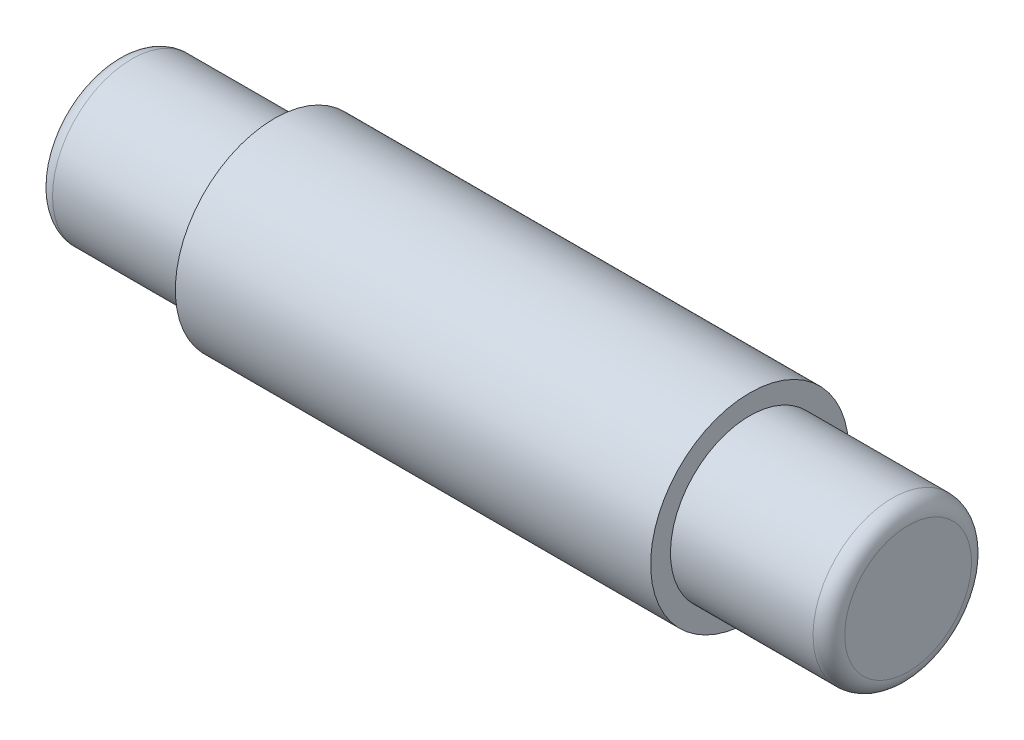
ISO-10303-21;
HEADER;
FILE_DESCRIPTION(('STEP AP214'),'2;1');
FILE_NAME('part.step','',(''),(''),'','','');
FILE_SCHEMA(('AUTOMOTIVE_DESIGN { 1 0 10303 214 1 1 1 1 }'));
ENDSEC;
DATA;
#1=APPLICATION_CONTEXT('core data for automotive mechanical design processes');
#2=APPLICATION_PROTOCOL_DEFINITION('international standard','automotive_design',2000,#1);
#3=PRODUCT_CONTEXT('',#1,'mechanical');
#4=PRODUCT('Part','Part','',(#3));
#5=PRODUCT_RELATED_PRODUCT_CATEGORY('part','',(#4));
#6=PRODUCT_DEFINITION_FORMATION('','',#4);
#7=PRODUCT_DEFINITION_CONTEXT('part definition',#1,'design');
#8=PRODUCT_DEFINITION('design','',#6,#7);
#9=PRODUCT_DEFINITION_SHAPE('','',#8);
#10=(LENGTH_UNIT() NAMED_UNIT(*) SI_UNIT(.MILLI.,.METRE.));
#11=(NAMED_UNIT(*) PLANE_ANGLE_UNIT() SI_UNIT($,.RADIAN.));
#12=(NAMED_UNIT(*) SI_UNIT($,.STERADIAN.) SOLID_ANGLE_UNIT());
#13=UNCERTAINTY_MEASURE_WITH_UNIT(LENGTH_MEASURE(1.E-05),#10,'distance_accuracy_value','');
#14=(GEOMETRIC_REPRESENTATION_CONTEXT(3) GLOBAL_UNCERTAINTY_ASSIGNED_CONTEXT((#13)) GLOBAL_UNIT_ASSIGNED_CONTEXT((#10,
#11,#12)) REPRESENTATION_CONTEXT('',''));
#15=CARTESIAN_POINT('',(0.,0.,0.));
#16=DIRECTION('',(0.,0.,1.));
#17=DIRECTION('',(1.,0.,0.));
#18=AXIS2_PLACEMENT_3D('',#15,#16,#17);
#19=CARTESIAN_POINT('',(-63.5,12.7,0.));
#20=DIRECTION('',(1.,0.,0.));
#21=DIRECTION('',(0.,1.,0.));
#22=AXIS2_PLACEMENT_3D('',#19,#20,#21);
#23=PLANE('',#22);
#24=CARTESIAN_POINT('',(-63.5,0.,0.));
#25=DIRECTION('',(1.,0.,0.));
#26=DIRECTION('',(0.,1.,0.));
#27=AXIS2_PLACEMENT_3D('',#24,#25,#26);
#28=CIRCLE('',#27,10.16);
#29=CARTESIAN_POINT('',(-63.5,10.16,0.));
#30=VERTEX_POINT('',#29);
#31=EDGE_CURVE('E55',#30,#30,#28,.F.);
#32=ORIENTED_EDGE('',*,*,#31,.T.);
#33=EDGE_LOOP('',(#32));
#34=FACE_BOUND('',#33,.T.);
#35=ADVANCED_FACE('F37',(#34),#23,.F.);
#36=CARTESIAN_POINT('',(63.5,0.,0.));
#37=DIRECTION('',(-1.,0.,0.));
#38=DIRECTION('',(0.,-1.,0.));
#39=AXIS2_PLACEMENT_3D('',#36,#37,#38);
#40=PLANE('',#39);
#41=CARTESIAN_POINT('',(63.5,0.,0.));
#42=DIRECTION('',(-1.,0.,0.));
#43=DIRECTION('',(0.,-1.,0.));
#44=AXIS2_PLACEMENT_3D('',#41,#42,#43);
#45=CIRCLE('',#44,10.16);
#46=CARTESIAN_POINT('',(63.5,-10.16,0.));
#47=VERTEX_POINT('',#46);
#48=EDGE_CURVE('E10',#47,#47,#45,.F.);
#49=ORIENTED_EDGE('',*,*,#48,.T.);
#50=EDGE_LOOP('',(#49));
#51=FACE_BOUND('',#50,.T.);
#52=ADVANCED_FACE('F100',(#51),#40,.F.);
#53=CARTESIAN_POINT('',(-63.5,0.,0.));
#54=DIRECTION('',(-1.,0.,0.));
#55=DIRECTION('',(0.,-1.,0.));
#56=AXIS2_PLACEMENT_3D('',#53,#54,#55);
#57=CYLINDRICAL_SURFACE('',#56,12.7);
#58=CARTESIAN_POINT('',(60.96,0.,0.));
#59=DIRECTION('',(-1.,0.,0.));
#60=DIRECTION('',(0.,-1.,0.));
#61=AXIS2_PLACEMENT_3D('',#58,#59,#60);
#62=CIRCLE('',#61,12.7);
#63=CARTESIAN_POINT('',(60.96,-12.7,0.));
#64=VERTEX_POINT('',#63);
#65=EDGE_CURVE('E45',#64,#64,#62,.T.);
#66=ORIENTED_EDGE('',*,*,#65,.T.);
#67=EDGE_LOOP('',(#66));
#68=FACE_BOUND('',#67,.T.);
#69=CARTESIAN_POINT('',(38.1,0.,0.));
#70=DIRECTION('',(-1.,0.,0.));
#71=DIRECTION('',(0.,-1.,0.));
#72=AXIS2_PLACEMENT_3D('',#69,#70,#71);
#73=CIRCLE('',#72,12.7);
#74=CARTESIAN_POINT('',(38.1,-12.7,0.));
#75=VERTEX_POINT('',#74);
#76=EDGE_CURVE('E61',#75,#75,#73,.T.);
#77=ORIENTED_EDGE('',*,*,#76,.F.);
#78=EDGE_LOOP('',(#77));
#79=FACE_BOUND('',#78,.T.);
#80=ADVANCED_FACE('F95',(#68,#79),#57,.T.);
#81=CARTESIAN_POINT('',(38.1,12.7,0.));
#82=DIRECTION('',(-1.,0.,0.));
#83=DIRECTION('',(0.,-1.,0.));
#84=AXIS2_PLACEMENT_3D('',#81,#82,#83);
#85=PLANE('',#84);
#86=CARTESIAN_POINT('',(38.1,0.,0.));
#87=DIRECTION('',(-1.,0.,0.));
#88=DIRECTION('',(0.,-1.,0.));
#89=AXIS2_PLACEMENT_3D('',#86,#87,#88);
#90=CIRCLE('',#89,15.875);
#91=CARTESIAN_POINT('',(38.1,-15.875,0.));
#92=VERTEX_POINT('',#91);
#93=EDGE_CURVE('E65',#92,#92,#90,.T.);
#94=ORIENTED_EDGE('',*,*,#93,.F.);
#95=EDGE_LOOP('',(#94));
#96=FACE_BOUND('',#95,.T.);
#97=ORIENTED_EDGE('',*,*,#76,.T.);
#98=EDGE_LOOP('',(#97));
#99=FACE_BOUND('',#98,.T.);
#100=ADVANCED_FACE('F89',(#96,#99),#85,.F.);
#101=CARTESIAN_POINT('',(-63.5,0.,0.));
#102=DIRECTION('',(-1.,0.,0.));
#103=DIRECTION('',(0.,-1.,0.));
#104=AXIS2_PLACEMENT_3D('',#101,#102,#103);
#105=CYLINDRICAL_SURFACE('',#104,15.875);
#106=CARTESIAN_POINT('',(-38.1,0.,0.));
#107=DIRECTION('',(-1.,0.,0.));
#108=DIRECTION('',(0.,-1.,0.));
#109=AXIS2_PLACEMENT_3D('',#106,#107,#108);
#110=CIRCLE('',#109,15.875);
#111=CARTESIAN_POINT('',(-38.1,-15.875,0.));
#112=VERTEX_POINT('',#111);
#113=EDGE_CURVE('E69',#112,#112,#110,.T.);
#114=ORIENTED_EDGE('',*,*,#113,.F.);
#115=EDGE_LOOP('',(#114));
#116=FACE_BOUND('',#115,.T.);
#117=ORIENTED_EDGE('',*,*,#93,.T.);
#118=EDGE_LOOP('',(#117));
#119=FACE_BOUND('',#118,.T.);
#120=ADVANCED_FACE('F83',(#116,#119),#105,.T.);
#121=CARTESIAN_POINT('',(-38.1,15.875,0.));
#122=DIRECTION('',(1.,0.,0.));
#123=DIRECTION('',(0.,1.,0.));
#124=AXIS2_PLACEMENT_3D('',#121,#122,#123);
#125=PLANE('',#124);
#126=CARTESIAN_POINT('',(-38.1,0.,0.));
#127=DIRECTION('',(-1.,0.,0.));
#128=DIRECTION('',(0.,-1.,0.));
#129=AXIS2_PLACEMENT_3D('',#126,#127,#128);
#130=CIRCLE('',#129,12.7);
#131=CARTESIAN_POINT('',(-38.1,-12.7,0.));
#132=VERTEX_POINT('',#131);
#133=EDGE_CURVE('E73',#132,#132,#130,.T.);
#134=ORIENTED_EDGE('',*,*,#133,.F.);
#135=EDGE_LOOP('',(#134));
#136=FACE_BOUND('',#135,.T.);
#137=ORIENTED_EDGE('',*,*,#113,.T.);
#138=EDGE_LOOP('',(#137));
#139=FACE_BOUND('',#138,.T.);
#140=ADVANCED_FACE('F80',(#136,#139),#125,.F.);
#141=CARTESIAN_POINT('',(-63.5,0.,0.));
#142=DIRECTION('',(-1.,0.,0.));
#143=DIRECTION('',(0.,-1.,0.));
#144=AXIS2_PLACEMENT_3D('',#141,#142,#143);
#145=CYLINDRICAL_SURFACE('',#144,12.7);
#146=CARTESIAN_POINT('',(-60.96,0.,0.));
#147=DIRECTION('',(1.,0.,0.));
#148=DIRECTION('',(0.,1.,0.));
#149=AXIS2_PLACEMENT_3D('',#146,#147,#148);
#150=CIRCLE('',#149,12.7);
#151=CARTESIAN_POINT('',(-60.96,12.7,0.));
#152=VERTEX_POINT('',#151);
#153=EDGE_CURVE('E50',#152,#152,#150,.T.);
#154=ORIENTED_EDGE('',*,*,#153,.T.);
#155=EDGE_LOOP('',(#154));
#156=FACE_BOUND('',#155,.T.);
#157=ORIENTED_EDGE('',*,*,#133,.T.);
#158=EDGE_LOOP('',(#157));
#159=FACE_BOUND('',#158,.T.);
#160=ADVANCED_FACE('F78',(#156,#159),#145,.T.);
#161=CARTESIAN_POINT('',(-60.96,0.,0.));
#162=DIRECTION('',(1.,0.,0.));
#163=DIRECTION('',(0.,1.,0.));
#164=AXIS2_PLACEMENT_3D('',#161,#162,#163);
#165=TOROIDAL_SURFACE('',#164,10.16,2.54);
#166=ORIENTED_EDGE('',*,*,#153,.F.);
#167=EDGE_LOOP('',(#166));
#168=FACE_BOUND('',#167,.T.);
#169=ORIENTED_EDGE('',*,*,#31,.F.);
#170=EDGE_LOOP('',(#169));
#171=FACE_BOUND('',#170,.T.);
#172=ADVANCED_FACE('F111',(#168,#171),#165,.T.);
#173=CARTESIAN_POINT('',(60.96,0.,0.));
#174=DIRECTION('',(-1.,0.,0.));
#175=DIRECTION('',(0.,-1.,0.));
#176=AXIS2_PLACEMENT_3D('',#173,#174,#175);
#177=TOROIDAL_SURFACE('',#176,10.16,2.54);
#178=ORIENTED_EDGE('',*,*,#48,.F.);
#179=EDGE_LOOP('',(#178));
#180=FACE_BOUND('',#179,.T.);
#181=ORIENTED_EDGE('',*,*,#65,.F.);
#182=EDGE_LOOP('',(#181));
#183=FACE_BOUND('',#182,.T.);
#184=ADVANCED_FACE('F39',(#180,#183),#177,.T.);
#185=CLOSED_SHELL('',(#35,#52,#80,#100,#120,#140,#160,#172,#184));
#186=MANIFOLD_SOLID_BREP('B2',#185);
#187=ADVANCED_BREP_SHAPE_REPRESENTATION('',(#18,#186),#14);
#188=SHAPE_DEFINITION_REPRESENTATION(#9,#187);
ENDSEC;
END-ISO-10303-21;
